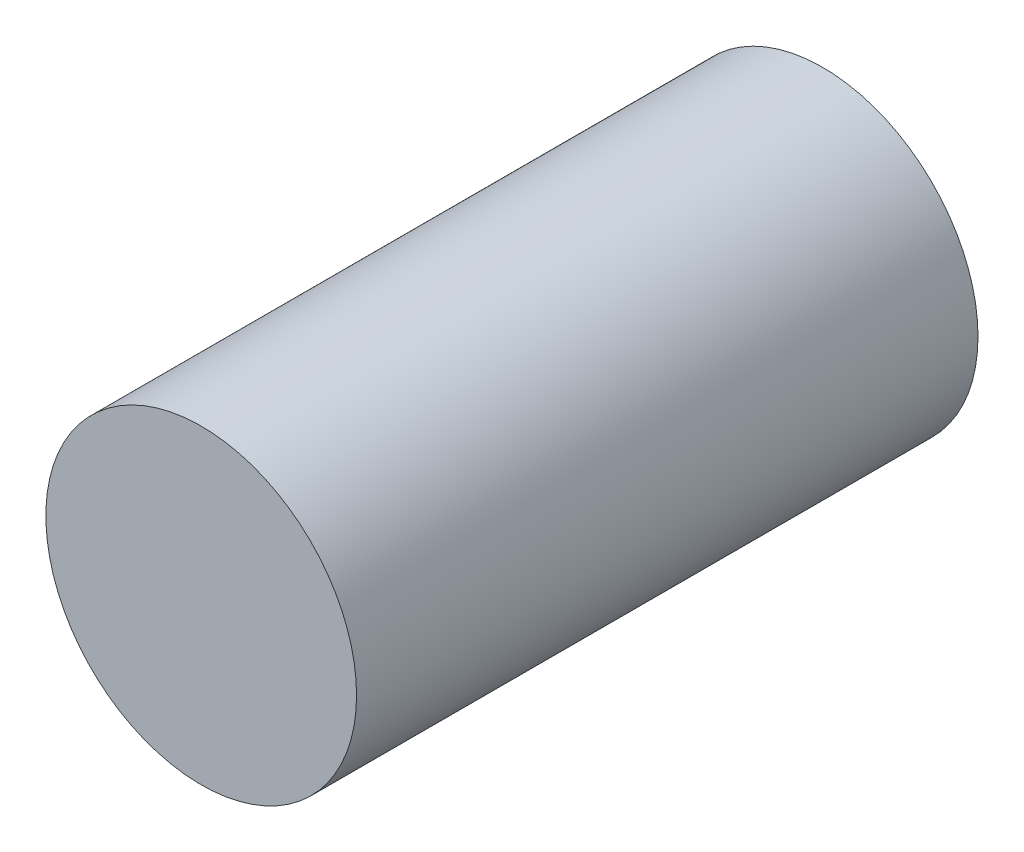
ISO-10303-21;
HEADER;
FILE_DESCRIPTION(('STEP AP214'),'2;1');
FILE_NAME('part.step','',(''),(''),'','','');
FILE_SCHEMA(('AUTOMOTIVE_DESIGN { 1 0 10303 214 1 1 1 1 }'));
ENDSEC;
DATA;
#1=APPLICATION_CONTEXT('core data for automotive mechanical design processes');
#2=APPLICATION_PROTOCOL_DEFINITION('international standard','automotive_design',2000,#1);
#3=PRODUCT_CONTEXT('',#1,'mechanical');
#4=PRODUCT('Part','Part','',(#3));
#5=PRODUCT_RELATED_PRODUCT_CATEGORY('part','',(#4));
#6=PRODUCT_DEFINITION_FORMATION('','',#4);
#7=PRODUCT_DEFINITION_CONTEXT('part definition',#1,'design');
#8=PRODUCT_DEFINITION('design','',#6,#7);
#9=PRODUCT_DEFINITION_SHAPE('','',#8);
#10=(LENGTH_UNIT() NAMED_UNIT(*) SI_UNIT(.MILLI.,.METRE.));
#11=(NAMED_UNIT(*) PLANE_ANGLE_UNIT() SI_UNIT($,.RADIAN.));
#12=(NAMED_UNIT(*) SI_UNIT($,.STERADIAN.) SOLID_ANGLE_UNIT());
#13=UNCERTAINTY_MEASURE_WITH_UNIT(LENGTH_MEASURE(1.E-05),#10,'distance_accuracy_value','');
#14=(GEOMETRIC_REPRESENTATION_CONTEXT(3) GLOBAL_UNCERTAINTY_ASSIGNED_CONTEXT((#13)) GLOBAL_UNIT_ASSIGNED_CONTEXT((#10,
#11,#12)) REPRESENTATION_CONTEXT('',''));
#15=CARTESIAN_POINT('',(0.,0.,0.));
#16=DIRECTION('',(0.,0.,1.));
#17=DIRECTION('',(1.,0.,0.));
#18=AXIS2_PLACEMENT_3D('',#15,#16,#17);
#19=CARTESIAN_POINT('',(0.,0.,2.00000108));
#20=DIRECTION('',(0.,0.,1.));
#21=DIRECTION('',(1.,0.,0.));
#22=AXIS2_PLACEMENT_3D('',#19,#20,#21);
#23=PLANE('',#22);
#24=CARTESIAN_POINT('',(0.,0.,2.00000108));
#25=DIRECTION('',(0.,0.,1.));
#26=DIRECTION('',(1.,0.,0.));
#27=AXIS2_PLACEMENT_3D('',#24,#25,#26);
#28=CIRCLE('',#27,0.499999);
#29=CARTESIAN_POINT('',(0.499999,0.,2.00000108));
#30=VERTEX_POINT('',#29);
#31=EDGE_CURVE('E11',#30,#30,#28,.T.);
#32=ORIENTED_EDGE('',*,*,#31,.T.);
#33=EDGE_LOOP('',(#32));
#34=FACE_BOUND('',#33,.T.);
#35=ADVANCED_FACE('F17',(#34),#23,.T.);
#36=CARTESIAN_POINT('',(0.,0.,0.));
#37=DIRECTION('',(0.,0.,1.));
#38=DIRECTION('',(1.,0.,0.));
#39=AXIS2_PLACEMENT_3D('',#36,#37,#38);
#40=PLANE('',#39);
#41=CARTESIAN_POINT('',(0.,0.,0.));
#42=DIRECTION('',(0.,0.,1.));
#43=DIRECTION('',(1.,0.,0.));
#44=AXIS2_PLACEMENT_3D('',#41,#42,#43);
#45=CIRCLE('',#44,0.499999);
#46=CARTESIAN_POINT('',(0.499999,0.,0.));
#47=VERTEX_POINT('',#46);
#48=EDGE_CURVE('E42',#47,#47,#45,.T.);
#49=ORIENTED_EDGE('',*,*,#48,.F.);
#50=EDGE_LOOP('',(#49));
#51=FACE_BOUND('',#50,.T.);
#52=ADVANCED_FACE('F64',(#51),#40,.F.);
#53=CARTESIAN_POINT('',(0.,0.,0.));
#54=DIRECTION('',(0.,0.,-1.));
#55=DIRECTION('',(1.,0.,0.));
#56=AXIS2_PLACEMENT_3D('',#53,#54,#55);
#57=CYLINDRICAL_SURFACE('',#56,0.499999);
#58=ORIENTED_EDGE('',*,*,#48,.T.);
#59=DIRECTION('',(0.,0.,1.));
#60=VECTOR('',#59,1.);
#61=CARTESIAN_POINT('',(0.499999,0.,0.));
#62=LINE('',#61,#60);
#63=EDGE_CURVE('E20',#47,#30,#62,.T.);
#64=ORIENTED_EDGE('',*,*,#63,.T.);
#65=ORIENTED_EDGE('',*,*,#31,.F.);
#66=ORIENTED_EDGE('',*,*,#63,.F.);
#67=EDGE_LOOP('',(#58,#64,#65,#66));
#68=FACE_BOUND('',#67,.T.);
#69=ADVANCED_FACE('F40',(#68),#57,.T.);
#70=CLOSED_SHELL('',(#35,#52,#69));
#71=MANIFOLD_SOLID_BREP('B1',#70);
#72=ADVANCED_BREP_SHAPE_REPRESENTATION('',(#18,#71),#14);
#73=SHAPE_DEFINITION_REPRESENTATION(#9,#72);
ENDSEC;
END-ISO-10303-21;
